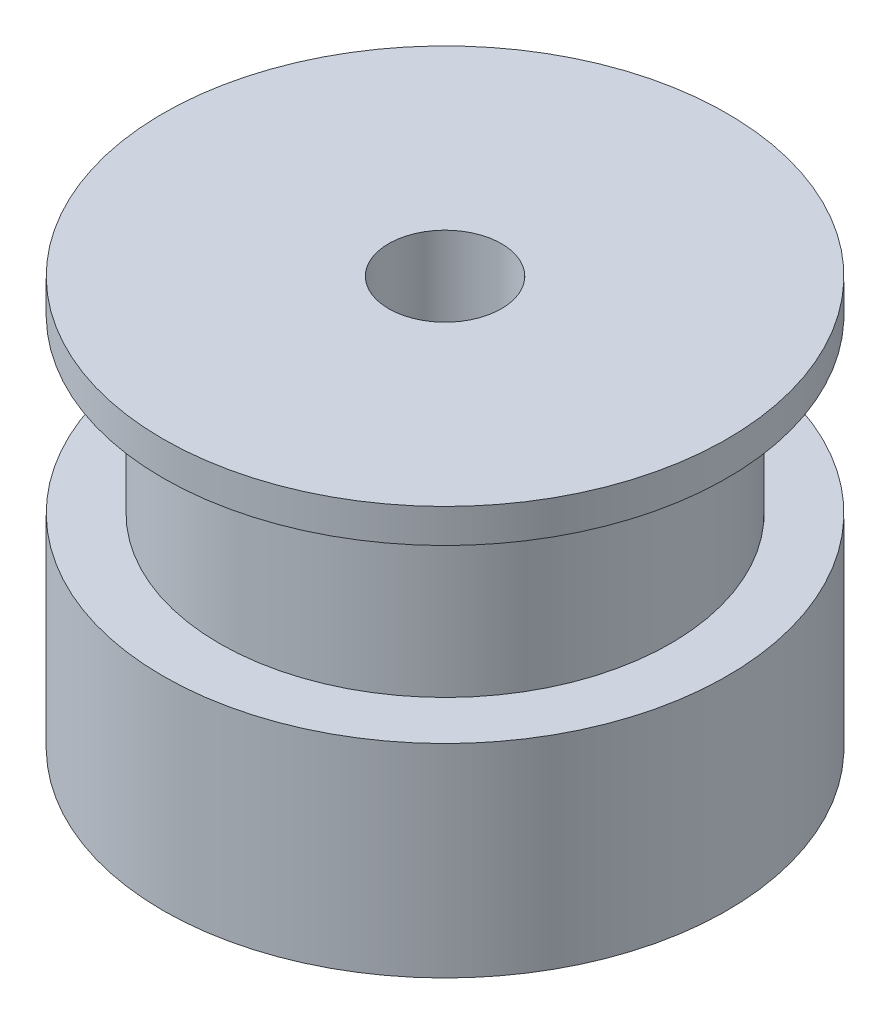
ISO-10303-21;
HEADER;
FILE_DESCRIPTION(('STEP AP214'),'2;1');
FILE_NAME('part.step','',(''),(''),'','','');
FILE_SCHEMA(('AUTOMOTIVE_DESIGN { 1 0 10303 214 1 1 1 1 }'));
ENDSEC;
DATA;
#1=APPLICATION_CONTEXT('core data for automotive mechanical design processes');
#2=APPLICATION_PROTOCOL_DEFINITION('international standard','automotive_design',2000,#1);
#3=PRODUCT_CONTEXT('',#1,'mechanical');
#4=PRODUCT('Part','Part','',(#3));
#5=PRODUCT_RELATED_PRODUCT_CATEGORY('part','',(#4));
#6=PRODUCT_DEFINITION_FORMATION('','',#4);
#7=PRODUCT_DEFINITION_CONTEXT('part definition',#1,'design');
#8=PRODUCT_DEFINITION('design','',#6,#7);
#9=PRODUCT_DEFINITION_SHAPE('','',#8);
#10=(LENGTH_UNIT() NAMED_UNIT(*) SI_UNIT(.MILLI.,.METRE.));
#11=(NAMED_UNIT(*) PLANE_ANGLE_UNIT() SI_UNIT($,.RADIAN.));
#12=(NAMED_UNIT(*) SI_UNIT($,.STERADIAN.) SOLID_ANGLE_UNIT());
#13=UNCERTAINTY_MEASURE_WITH_UNIT(LENGTH_MEASURE(1.E-05),#10,'distance_accuracy_value','');
#14=(GEOMETRIC_REPRESENTATION_CONTEXT(3) GLOBAL_UNCERTAINTY_ASSIGNED_CONTEXT((#13)) GLOBAL_UNIT_ASSIGNED_CONTEXT((#10,
#11,#12)) REPRESENTATION_CONTEXT('',''));
#15=CARTESIAN_POINT('',(0.,0.,0.));
#16=DIRECTION('',(0.,0.,1.));
#17=DIRECTION('',(1.,0.,0.));
#18=AXIS2_PLACEMENT_3D('',#15,#16,#17);
#19=CARTESIAN_POINT('',(0.,9.,0.));
#20=DIRECTION('',(0.,1.,0.));
#21=DIRECTION('',(0.,0.,1.));
#22=AXIS2_PLACEMENT_3D('',#19,#20,#21);
#23=PLANE('',#22);
#24=CARTESIAN_POINT('',(0.,9.,0.));
#25=DIRECTION('',(0.,1.,0.));
#26=DIRECTION('',(0.,0.,1.));
#27=AXIS2_PLACEMENT_3D('',#24,#25,#26);
#28=CIRCLE('',#27,12.5);
#29=CARTESIAN_POINT('',(0.,9.,12.5));
#30=VERTEX_POINT('',#29);
#31=EDGE_CURVE('E10',#30,#30,#28,.T.);
#32=ORIENTED_EDGE('',*,*,#31,.T.);
#33=EDGE_LOOP('',(#32));
#34=FACE_BOUND('',#33,.T.);
#35=CARTESIAN_POINT('',(0.,9.,0.));
#36=DIRECTION('',(0.,1.,0.));
#37=DIRECTION('',(0.,0.,1.));
#38=AXIS2_PLACEMENT_3D('',#35,#36,#37);
#39=CIRCLE('',#38,10.);
#40=CARTESIAN_POINT('',(0.,9.,10.));
#41=VERTEX_POINT('',#40);
#42=EDGE_CURVE('E43',#41,#41,#39,.T.);
#43=ORIENTED_EDGE('',*,*,#42,.F.);
#44=EDGE_LOOP('',(#43));
#45=FACE_BOUND('',#44,.T.);
#46=ADVANCED_FACE('F30',(#34,#45),#23,.T.);
#47=CARTESIAN_POINT('',(0.,9.,0.));
#48=DIRECTION('',(0.,-1.,0.));
#49=DIRECTION('',(0.,0.,-1.));
#50=AXIS2_PLACEMENT_3D('',#47,#48,#49);
#51=CYLINDRICAL_SURFACE('',#50,12.5);
#52=ORIENTED_EDGE('',*,*,#31,.F.);
#53=EDGE_LOOP('',(#52));
#54=FACE_BOUND('',#53,.T.);
#55=CARTESIAN_POINT('',(0.,0.,0.));
#56=DIRECTION('',(0.,1.,0.));
#57=DIRECTION('',(0.,0.,1.));
#58=AXIS2_PLACEMENT_3D('',#55,#56,#57);
#59=CIRCLE('',#58,12.5);
#60=CARTESIAN_POINT('',(0.,0.,12.5));
#61=VERTEX_POINT('',#60);
#62=EDGE_CURVE('E34',#61,#61,#59,.T.);
#63=ORIENTED_EDGE('',*,*,#62,.T.);
#64=EDGE_LOOP('',(#63));
#65=FACE_BOUND('',#64,.T.);
#66=ADVANCED_FACE('F32',(#54,#65),#51,.T.);
#67=CARTESIAN_POINT('',(0.,0.,0.));
#68=DIRECTION('',(0.,1.,0.));
#69=DIRECTION('',(0.,0.,1.));
#70=AXIS2_PLACEMENT_3D('',#67,#68,#69);
#71=PLANE('',#70);
#72=CARTESIAN_POINT('',(0.,0.,0.));
#73=DIRECTION('',(0.,1.,0.));
#74=DIRECTION('',(0.,0.,1.));
#75=AXIS2_PLACEMENT_3D('',#72,#73,#74);
#76=CIRCLE('',#75,2.5);
#77=CARTESIAN_POINT('',(0.,0.,2.5));
#78=VERTEX_POINT('',#77);
#79=EDGE_CURVE('E52',#78,#78,#76,.T.);
#80=ORIENTED_EDGE('',*,*,#79,.T.);
#81=EDGE_LOOP('',(#80));
#82=FACE_BOUND('',#81,.T.);
#83=ORIENTED_EDGE('',*,*,#62,.F.);
#84=EDGE_LOOP('',(#83));
#85=FACE_BOUND('',#84,.T.);
#86=ADVANCED_FACE('F61',(#82,#85),#71,.F.);
#87=CARTESIAN_POINT('',(0.,16.6,0.));
#88=DIRECTION('',(0.,-1.,0.));
#89=DIRECTION('',(0.,0.,-1.));
#90=AXIS2_PLACEMENT_3D('',#87,#88,#89);
#91=CYLINDRICAL_SURFACE('',#90,10.);
#92=CARTESIAN_POINT('',(0.,16.6,0.));
#93=DIRECTION('',(0.,1.,0.));
#94=DIRECTION('',(0.,0.,1.));
#95=AXIS2_PLACEMENT_3D('',#92,#93,#94);
#96=CIRCLE('',#95,10.);
#97=CARTESIAN_POINT('',(0.,16.6,10.));
#98=VERTEX_POINT('',#97);
#99=EDGE_CURVE('E41',#98,#98,#96,.T.);
#100=ORIENTED_EDGE('',*,*,#99,.F.);
#101=EDGE_LOOP('',(#100));
#102=FACE_BOUND('',#101,.T.);
#103=ORIENTED_EDGE('',*,*,#42,.T.);
#104=EDGE_LOOP('',(#103));
#105=FACE_BOUND('',#104,.T.);
#106=ADVANCED_FACE('F85',(#102,#105),#91,.T.);
#107=CARTESIAN_POINT('',(0.,16.6,0.));
#108=DIRECTION('',(0.,1.,0.));
#109=DIRECTION('',(0.,0.,1.));
#110=AXIS2_PLACEMENT_3D('',#107,#108,#109);
#111=PLANE('',#110);
#112=CARTESIAN_POINT('',(0.,16.6,0.));
#113=DIRECTION('',(0.,1.,0.));
#114=DIRECTION('',(0.,0.,1.));
#115=AXIS2_PLACEMENT_3D('',#112,#113,#114);
#116=CIRCLE('',#115,12.5);
#117=CARTESIAN_POINT('',(0.,16.6,12.5));
#118=VERTEX_POINT('',#117);
#119=EDGE_CURVE('E49',#118,#118,#116,.T.);
#120=ORIENTED_EDGE('',*,*,#119,.F.);
#121=EDGE_LOOP('',(#120));
#122=FACE_BOUND('',#121,.T.);
#123=ORIENTED_EDGE('',*,*,#99,.T.);
#124=EDGE_LOOP('',(#123));
#125=FACE_BOUND('',#124,.T.);
#126=ADVANCED_FACE('F79',(#122,#125),#111,.F.);
#127=CARTESIAN_POINT('',(0.,18.1,0.));
#128=DIRECTION('',(0.,-1.,0.));
#129=DIRECTION('',(0.,0.,-1.));
#130=AXIS2_PLACEMENT_3D('',#127,#128,#129);
#131=CYLINDRICAL_SURFACE('',#130,12.5);
#132=CARTESIAN_POINT('',(0.,18.1,0.));
#133=DIRECTION('',(0.,1.,0.));
#134=DIRECTION('',(0.,0.,1.));
#135=AXIS2_PLACEMENT_3D('',#132,#133,#134);
#136=CIRCLE('',#135,12.5);
#137=CARTESIAN_POINT('',(0.,18.1,12.5));
#138=VERTEX_POINT('',#137);
#139=EDGE_CURVE('E46',#138,#138,#136,.T.);
#140=ORIENTED_EDGE('',*,*,#139,.F.);
#141=EDGE_LOOP('',(#140));
#142=FACE_BOUND('',#141,.T.);
#143=ORIENTED_EDGE('',*,*,#119,.T.);
#144=EDGE_LOOP('',(#143));
#145=FACE_BOUND('',#144,.T.);
#146=ADVANCED_FACE('F73',(#142,#145),#131,.T.);
#147=CARTESIAN_POINT('',(0.,18.1,0.));
#148=DIRECTION('',(0.,1.,0.));
#149=DIRECTION('',(0.,0.,1.));
#150=AXIS2_PLACEMENT_3D('',#147,#148,#149);
#151=PLANE('',#150);
#152=CARTESIAN_POINT('',(0.,18.1,0.));
#153=DIRECTION('',(0.,1.,0.));
#154=DIRECTION('',(0.,0.,1.));
#155=AXIS2_PLACEMENT_3D('',#152,#153,#154);
#156=CIRCLE('',#155,2.5);
#157=CARTESIAN_POINT('',(0.,18.1,2.5));
#158=VERTEX_POINT('',#157);
#159=EDGE_CURVE('E55',#158,#158,#156,.T.);
#160=ORIENTED_EDGE('',*,*,#159,.F.);
#161=EDGE_LOOP('',(#160));
#162=FACE_BOUND('',#161,.T.);
#163=ORIENTED_EDGE('',*,*,#139,.T.);
#164=EDGE_LOOP('',(#163));
#165=FACE_BOUND('',#164,.T.);
#166=ADVANCED_FACE('F67',(#162,#165),#151,.T.);
#167=CARTESIAN_POINT('',(0.,0.,0.));
#168=DIRECTION('',(0.,1.,0.));
#169=DIRECTION('',(0.,0.,1.));
#170=AXIS2_PLACEMENT_3D('',#167,#168,#169);
#171=CYLINDRICAL_SURFACE('',#170,2.5);
#172=ORIENTED_EDGE('',*,*,#79,.F.);
#173=EDGE_LOOP('',(#172));
#174=FACE_BOUND('',#173,.T.);
#175=ORIENTED_EDGE('',*,*,#159,.T.);
#176=EDGE_LOOP('',(#175));
#177=FACE_BOUND('',#176,.T.);
#178=ADVANCED_FACE('F64',(#174,#177),#171,.F.);
#179=CLOSED_SHELL('',(#46,#66,#86,#106,#126,#146,#166,#178));
#180=MANIFOLD_SOLID_BREP('B2',#179);
#181=ADVANCED_BREP_SHAPE_REPRESENTATION('',(#18,#180),#14);
#182=SHAPE_DEFINITION_REPRESENTATION(#9,#181);
ENDSEC;
END-ISO-10303-21;
